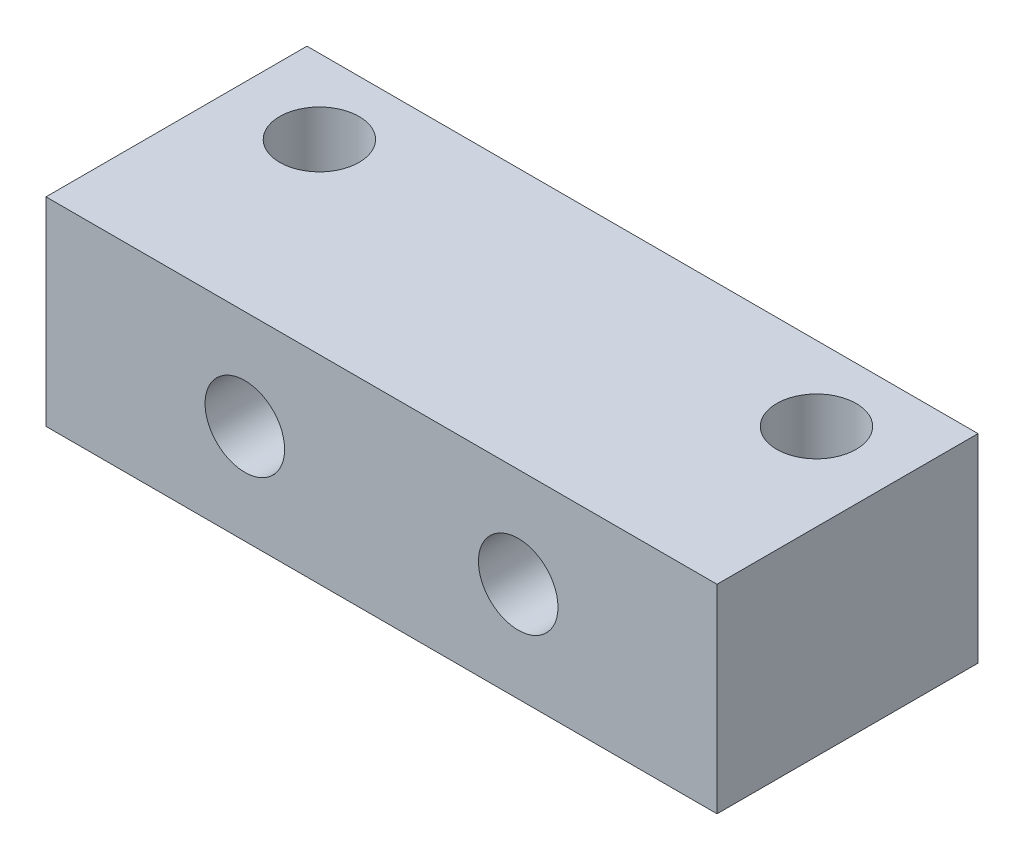
ISO-10303-21;
HEADER;
FILE_DESCRIPTION(('STEP AP214'),'2;1');
FILE_NAME('part.step','',(''),(''),'','','');
FILE_SCHEMA(('AUTOMOTIVE_DESIGN { 1 0 10303 214 1 1 1 1 }'));
ENDSEC;
DATA;
#1=APPLICATION_CONTEXT('core data for automotive mechanical design processes');
#2=APPLICATION_PROTOCOL_DEFINITION('international standard','automotive_design',2000,#1);
#3=PRODUCT_CONTEXT('',#1,'mechanical');
#4=PRODUCT('Part','Part','',(#3));
#5=PRODUCT_RELATED_PRODUCT_CATEGORY('part','',(#4));
#6=PRODUCT_DEFINITION_FORMATION('','',#4);
#7=PRODUCT_DEFINITION_CONTEXT('part definition',#1,'design');
#8=PRODUCT_DEFINITION('design','',#6,#7);
#9=PRODUCT_DEFINITION_SHAPE('','',#8);
#10=(LENGTH_UNIT() NAMED_UNIT(*) SI_UNIT(.MILLI.,.METRE.));
#11=(NAMED_UNIT(*) PLANE_ANGLE_UNIT() SI_UNIT($,.RADIAN.));
#12=(NAMED_UNIT(*) SI_UNIT($,.STERADIAN.) SOLID_ANGLE_UNIT());
#13=UNCERTAINTY_MEASURE_WITH_UNIT(LENGTH_MEASURE(1.E-05),#10,'distance_accuracy_value','');
#14=(GEOMETRIC_REPRESENTATION_CONTEXT(3) GLOBAL_UNCERTAINTY_ASSIGNED_CONTEXT((#13)) GLOBAL_UNIT_ASSIGNED_CONTEXT((#10,
#11,#12)) REPRESENTATION_CONTEXT('',''));
#15=CARTESIAN_POINT('',(0.,0.,0.));
#16=DIRECTION('',(0.,0.,1.));
#17=DIRECTION('',(1.,0.,0.));
#18=AXIS2_PLACEMENT_3D('',#15,#16,#17);
#19=CARTESIAN_POINT('',(0.,8.,0.));
#20=DIRECTION('',(0.,-1.,0.));
#21=DIRECTION('',(0.,0.,-1.));
#22=AXIS2_PLACEMENT_3D('',#19,#20,#21);
#23=PLANE('',#22);
#24=DIRECTION('',(0.,0.,-1.));
#25=VECTOR('',#24,1.);
#26=CARTESIAN_POINT('',(23.5,8.,3.));
#27=LINE('',#26,#25);
#28=CARTESIAN_POINT('',(23.5,8.,7.5));
#29=VERTEX_POINT('',#28);
#30=CARTESIAN_POINT('',(23.5,8.,-3.));
#31=VERTEX_POINT('',#30);
#32=EDGE_CURVE('E96',#29,#31,#27,.T.);
#33=ORIENTED_EDGE('',*,*,#32,.T.);
#34=DIRECTION('',(-1.,0.,0.));
#35=VECTOR('',#34,1.);
#36=CARTESIAN_POINT('',(-3.5,8.,-3.));
#37=LINE('',#36,#35);
#38=CARTESIAN_POINT('',(-3.5,8.,-3.));
#39=VERTEX_POINT('',#38);
#40=EDGE_CURVE('E63',#31,#39,#37,.T.);
#41=ORIENTED_EDGE('',*,*,#40,.T.);
#42=DIRECTION('',(0.,0.,1.));
#43=VECTOR('',#42,1.);
#44=CARTESIAN_POINT('',(-3.5,8.,3.));
#45=LINE('',#44,#43);
#46=CARTESIAN_POINT('',(-3.5,8.,7.5));
#47=VERTEX_POINT('',#46);
#48=EDGE_CURVE('E78',#39,#47,#45,.T.);
#49=ORIENTED_EDGE('',*,*,#48,.T.);
#50=DIRECTION('',(-1.,0.,0.));
#51=VECTOR('',#50,1.);
#52=CARTESIAN_POINT('',(-3.5,8.,7.5));
#53=LINE('',#52,#51);
#54=EDGE_CURVE('E111',#29,#47,#53,.T.);
#55=ORIENTED_EDGE('',*,*,#54,.F.);
#56=EDGE_LOOP('',(#33,#41,#49,#55));
#57=FACE_BOUND('',#56,.T.);
#58=CARTESIAN_POINT('',(0.,8.,0.));
#59=DIRECTION('',(0.,1.,0.));
#60=DIRECTION('',(0.,0.,1.));
#61=AXIS2_PLACEMENT_3D('',#58,#59,#60);
#62=CIRCLE('',#61,1.6);
#63=CARTESIAN_POINT('',(0.,8.,1.6));
#64=VERTEX_POINT('',#63);
#65=EDGE_CURVE('E136',#64,#64,#62,.T.);
#66=ORIENTED_EDGE('',*,*,#65,.F.);
#67=EDGE_LOOP('',(#66));
#68=FACE_BOUND('',#67,.T.);
#69=CARTESIAN_POINT('',(20.,8.,0.));
#70=DIRECTION('',(0.,1.,0.));
#71=DIRECTION('',(0.,0.,1.));
#72=AXIS2_PLACEMENT_3D('',#69,#70,#71);
#73=CIRCLE('',#72,1.6);
#74=CARTESIAN_POINT('',(20.,8.,1.6));
#75=VERTEX_POINT('',#74);
#76=EDGE_CURVE('E128',#75,#75,#73,.T.);
#77=ORIENTED_EDGE('',*,*,#76,.F.);
#78=EDGE_LOOP('',(#77));
#79=FACE_BOUND('',#78,.T.);
#80=ADVANCED_FACE('F45',(#57,#68,#79),#23,.F.);
#81=CARTESIAN_POINT('',(0.,0.,0.));
#82=DIRECTION('',(0.,-1.,0.));
#83=DIRECTION('',(0.,0.,-1.));
#84=AXIS2_PLACEMENT_3D('',#81,#82,#83);
#85=PLANE('',#84);
#86=CARTESIAN_POINT('',(0.,0.,0.));
#87=DIRECTION('',(0.,1.,0.));
#88=DIRECTION('',(0.,0.,1.));
#89=AXIS2_PLACEMENT_3D('',#86,#87,#88);
#90=CIRCLE('',#89,1.6);
#91=CARTESIAN_POINT('',(0.,0.,1.6));
#92=VERTEX_POINT('',#91);
#93=EDGE_CURVE('E132',#92,#92,#90,.T.);
#94=ORIENTED_EDGE('',*,*,#93,.T.);
#95=EDGE_LOOP('',(#94));
#96=FACE_BOUND('',#95,.T.);
#97=DIRECTION('',(0.,0.,-1.));
#98=VECTOR('',#97,1.);
#99=CARTESIAN_POINT('',(23.5,0.,3.));
#100=LINE('',#99,#98);
#101=CARTESIAN_POINT('',(23.5,0.,7.5));
#102=VERTEX_POINT('',#101);
#103=CARTESIAN_POINT('',(23.5,0.,-3.));
#104=VERTEX_POINT('',#103);
#105=EDGE_CURVE('E103',#102,#104,#100,.T.);
#106=ORIENTED_EDGE('',*,*,#105,.F.);
#107=DIRECTION('',(1.,0.,0.));
#108=VECTOR('',#107,1.);
#109=CARTESIAN_POINT('',(-3.5,0.,7.5));
#110=LINE('',#109,#108);
#111=CARTESIAN_POINT('',(-3.5,0.,7.5));
#112=VERTEX_POINT('',#111);
#113=EDGE_CURVE('E99',#112,#102,#110,.T.);
#114=ORIENTED_EDGE('',*,*,#113,.F.);
#115=DIRECTION('',(0.,0.,1.));
#116=VECTOR('',#115,1.);
#117=CARTESIAN_POINT('',(-3.5,0.,3.));
#118=LINE('',#117,#116);
#119=CARTESIAN_POINT('',(-3.5,0.,-3.));
#120=VERTEX_POINT('',#119);
#121=EDGE_CURVE('E90',#120,#112,#118,.T.);
#122=ORIENTED_EDGE('',*,*,#121,.F.);
#123=DIRECTION('',(-1.,0.,0.));
#124=VECTOR('',#123,1.);
#125=CARTESIAN_POINT('',(-3.5,0.,-3.));
#126=LINE('',#125,#124);
#127=EDGE_CURVE('E74',#104,#120,#126,.T.);
#128=ORIENTED_EDGE('',*,*,#127,.F.);
#129=EDGE_LOOP('',(#106,#114,#122,#128));
#130=FACE_BOUND('',#129,.T.);
#131=CARTESIAN_POINT('',(20.,0.,0.));
#132=DIRECTION('',(0.,1.,0.));
#133=DIRECTION('',(0.,0.,1.));
#134=AXIS2_PLACEMENT_3D('',#131,#132,#133);
#135=CIRCLE('',#134,1.6);
#136=CARTESIAN_POINT('',(20.,0.,1.6));
#137=VERTEX_POINT('',#136);
#138=EDGE_CURVE('E127',#137,#137,#135,.T.);
#139=ORIENTED_EDGE('',*,*,#138,.T.);
#140=EDGE_LOOP('',(#139));
#141=FACE_BOUND('',#140,.T.);
#142=ADVANCED_FACE('F100',(#96,#130,#141),#85,.T.);
#143=CARTESIAN_POINT('',(23.5,8.,3.));
#144=DIRECTION('',(-1.,0.,0.));
#145=DIRECTION('',(0.,0.,1.));
#146=AXIS2_PLACEMENT_3D('',#143,#144,#145);
#147=PLANE('',#146);
#148=ORIENTED_EDGE('',*,*,#105,.T.);
#149=DIRECTION('',(0.,-1.,0.));
#150=VECTOR('',#149,1.);
#151=CARTESIAN_POINT('',(23.5,8.,-3.));
#152=LINE('',#151,#150);
#153=EDGE_CURVE('E11',#31,#104,#152,.T.);
#154=ORIENTED_EDGE('',*,*,#153,.F.);
#155=ORIENTED_EDGE('',*,*,#32,.F.);
#156=DIRECTION('',(0.,1.,0.));
#157=VECTOR('',#156,1.);
#158=CARTESIAN_POINT('',(23.5,0.,7.5));
#159=LINE('',#158,#157);
#160=EDGE_CURVE('E108',#102,#29,#159,.T.);
#161=ORIENTED_EDGE('',*,*,#160,.F.);
#162=EDGE_LOOP('',(#148,#154,#155,#161));
#163=FACE_BOUND('',#162,.T.);
#164=ADVANCED_FACE('F47',(#163),#147,.F.);
#165=CARTESIAN_POINT('',(-3.5,8.,-3.));
#166=DIRECTION('',(0.,0.,1.));
#167=DIRECTION('',(1.,0.,0.));
#168=AXIS2_PLACEMENT_3D('',#165,#166,#167);
#169=PLANE('',#168);
#170=CARTESIAN_POINT('',(4.5,4.,-3.));
#171=DIRECTION('',(0.,0.,1.));
#172=DIRECTION('',(1.,0.,0.));
#173=AXIS2_PLACEMENT_3D('',#170,#171,#172);
#174=CIRCLE('',#173,1.6);
#175=CARTESIAN_POINT('',(6.1,4.,-3.));
#176=VERTEX_POINT('',#175);
#177=EDGE_CURVE('E113',#176,#176,#174,.T.);
#178=ORIENTED_EDGE('',*,*,#177,.T.);
#179=EDGE_LOOP('',(#178));
#180=FACE_BOUND('',#179,.T.);
#181=CARTESIAN_POINT('',(15.5,4.,-3.));
#182=DIRECTION('',(0.,0.,1.));
#183=DIRECTION('',(1.,0.,0.));
#184=AXIS2_PLACEMENT_3D('',#181,#182,#183);
#185=CIRCLE('',#184,1.6);
#186=CARTESIAN_POINT('',(17.1,4.,-3.));
#187=VERTEX_POINT('',#186);
#188=EDGE_CURVE('E120',#187,#187,#185,.T.);
#189=ORIENTED_EDGE('',*,*,#188,.T.);
#190=EDGE_LOOP('',(#189));
#191=FACE_BOUND('',#190,.T.);
#192=ORIENTED_EDGE('',*,*,#127,.T.);
#193=DIRECTION('',(0.,-1.,0.));
#194=VECTOR('',#193,1.);
#195=CARTESIAN_POINT('',(-3.5,8.,-3.));
#196=LINE('',#195,#194);
#197=EDGE_CURVE('E55',#39,#120,#196,.T.);
#198=ORIENTED_EDGE('',*,*,#197,.F.);
#199=ORIENTED_EDGE('',*,*,#40,.F.);
#200=ORIENTED_EDGE('',*,*,#153,.T.);
#201=EDGE_LOOP('',(#192,#198,#199,#200));
#202=FACE_BOUND('',#201,.T.);
#203=ADVANCED_FACE('F154',(#180,#191,#202),#169,.F.);
#204=CARTESIAN_POINT('',(-3.5,8.,3.));
#205=DIRECTION('',(1.,0.,0.));
#206=DIRECTION('',(0.,0.,-1.));
#207=AXIS2_PLACEMENT_3D('',#204,#205,#206);
#208=PLANE('',#207);
#209=ORIENTED_EDGE('',*,*,#121,.T.);
#210=DIRECTION('',(0.,-1.,0.));
#211=VECTOR('',#210,1.);
#212=CARTESIAN_POINT('',(-3.5,0.,7.5));
#213=LINE('',#212,#211);
#214=EDGE_CURVE('E94',#47,#112,#213,.T.);
#215=ORIENTED_EDGE('',*,*,#214,.F.);
#216=ORIENTED_EDGE('',*,*,#48,.F.);
#217=ORIENTED_EDGE('',*,*,#197,.T.);
#218=EDGE_LOOP('',(#209,#215,#216,#217));
#219=FACE_BOUND('',#218,.T.);
#220=ADVANCED_FACE('F92',(#219),#208,.F.);
#221=CARTESIAN_POINT('',(0.,8.,0.));
#222=DIRECTION('',(0.,-1.,0.));
#223=DIRECTION('',(0.,0.,-1.));
#224=AXIS2_PLACEMENT_3D('',#221,#222,#223);
#225=CYLINDRICAL_SURFACE('',#224,1.6);
#226=ORIENTED_EDGE('',*,*,#65,.T.);
#227=EDGE_LOOP('',(#226));
#228=FACE_BOUND('',#227,.T.);
#229=ORIENTED_EDGE('',*,*,#93,.F.);
#230=EDGE_LOOP('',(#229));
#231=FACE_BOUND('',#230,.T.);
#232=ADVANCED_FACE('F167',(#228,#231),#225,.F.);
#233=CARTESIAN_POINT('',(20.,8.,0.));
#234=DIRECTION('',(0.,-1.,0.));
#235=DIRECTION('',(0.,0.,-1.));
#236=AXIS2_PLACEMENT_3D('',#233,#234,#235);
#237=CYLINDRICAL_SURFACE('',#236,1.6);
#238=ORIENTED_EDGE('',*,*,#76,.T.);
#239=EDGE_LOOP('',(#238));
#240=FACE_BOUND('',#239,.T.);
#241=ORIENTED_EDGE('',*,*,#138,.F.);
#242=EDGE_LOOP('',(#241));
#243=FACE_BOUND('',#242,.T.);
#244=ADVANCED_FACE('F164',(#240,#243),#237,.F.);
#245=CARTESIAN_POINT('',(0.,0.,7.5));
#246=DIRECTION('',(0.,0.,-1.));
#247=DIRECTION('',(-1.,0.,0.));
#248=AXIS2_PLACEMENT_3D('',#245,#246,#247);
#249=PLANE('',#248);
#250=CARTESIAN_POINT('',(4.5,4.,7.5));
#251=DIRECTION('',(0.,0.,1.));
#252=DIRECTION('',(1.,0.,0.));
#253=AXIS2_PLACEMENT_3D('',#250,#251,#252);
#254=CIRCLE('',#253,1.6);
#255=CARTESIAN_POINT('',(6.1,4.,7.5));
#256=VERTEX_POINT('',#255);
#257=EDGE_CURVE('E117',#256,#256,#254,.T.);
#258=ORIENTED_EDGE('',*,*,#257,.F.);
#259=EDGE_LOOP('',(#258));
#260=FACE_BOUND('',#259,.T.);
#261=CARTESIAN_POINT('',(15.5,4.,7.5));
#262=DIRECTION('',(0.,0.,1.));
#263=DIRECTION('',(1.,0.,0.));
#264=AXIS2_PLACEMENT_3D('',#261,#262,#263);
#265=CIRCLE('',#264,1.6);
#266=CARTESIAN_POINT('',(17.1,4.,7.5));
#267=VERTEX_POINT('',#266);
#268=EDGE_CURVE('E190',#267,#267,#265,.T.);
#269=ORIENTED_EDGE('',*,*,#268,.F.);
#270=EDGE_LOOP('',(#269));
#271=FACE_BOUND('',#270,.T.);
#272=ORIENTED_EDGE('',*,*,#214,.T.);
#273=ORIENTED_EDGE('',*,*,#113,.T.);
#274=ORIENTED_EDGE('',*,*,#160,.T.);
#275=ORIENTED_EDGE('',*,*,#54,.T.);
#276=EDGE_LOOP('',(#272,#273,#274,#275));
#277=FACE_BOUND('',#276,.T.);
#278=ADVANCED_FACE('F110',(#260,#271,#277),#249,.F.);
#279=CARTESIAN_POINT('',(15.5,4.,-3.));
#280=DIRECTION('',(0.,0.,1.));
#281=DIRECTION('',(1.,0.,0.));
#282=AXIS2_PLACEMENT_3D('',#279,#280,#281);
#283=CYLINDRICAL_SURFACE('',#282,1.6);
#284=ORIENTED_EDGE('',*,*,#188,.F.);
#285=EDGE_LOOP('',(#284));
#286=FACE_BOUND('',#285,.T.);
#287=ORIENTED_EDGE('',*,*,#268,.T.);
#288=EDGE_LOOP('',(#287));
#289=FACE_BOUND('',#288,.T.);
#290=ADVANCED_FACE('F198',(#286,#289),#283,.F.);
#291=CARTESIAN_POINT('',(4.5,4.,-3.));
#292=DIRECTION('',(0.,0.,1.));
#293=DIRECTION('',(1.,0.,0.));
#294=AXIS2_PLACEMENT_3D('',#291,#292,#293);
#295=CYLINDRICAL_SURFACE('',#294,1.6);
#296=ORIENTED_EDGE('',*,*,#177,.F.);
#297=EDGE_LOOP('',(#296));
#298=FACE_BOUND('',#297,.T.);
#299=ORIENTED_EDGE('',*,*,#257,.T.);
#300=EDGE_LOOP('',(#299));
#301=FACE_BOUND('',#300,.T.);
#302=ADVANCED_FACE('F205',(#298,#301),#295,.F.);
#303=CLOSED_SHELL('',(#80,#142,#164,#203,#220,#232,#244,#278,#290,#302));
#304=MANIFOLD_SOLID_BREP('B2',#303);
#305=ADVANCED_BREP_SHAPE_REPRESENTATION('',(#18,#304),#14);
#306=SHAPE_DEFINITION_REPRESENTATION(#9,#305);
ENDSEC;
END-ISO-10303-21;
